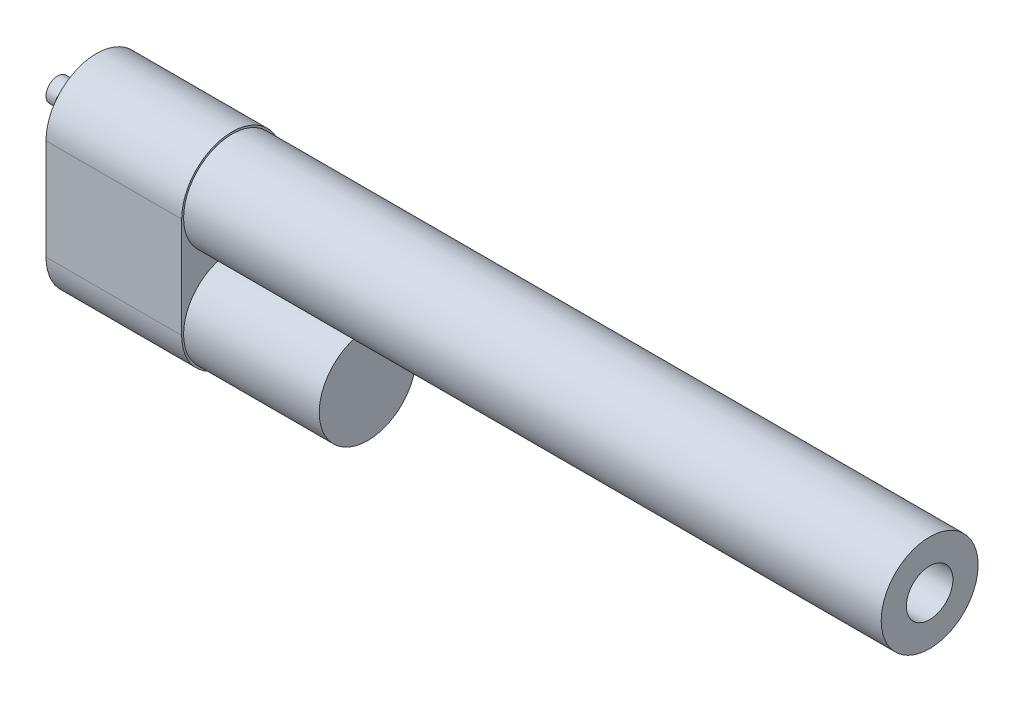
ISO-10303-21;
HEADER;
FILE_DESCRIPTION(('STEP AP214'),'2;1');
FILE_NAME('part.step','',(''),(''),'','','');
FILE_SCHEMA(('AUTOMOTIVE_DESIGN { 1 0 10303 214 1 1 1 1 }'));
ENDSEC;
DATA;
#1=APPLICATION_CONTEXT('core data for automotive mechanical design processes');
#2=APPLICATION_PROTOCOL_DEFINITION('international standard','automotive_design',2000,#1);
#3=PRODUCT_CONTEXT('',#1,'mechanical');
#4=PRODUCT('Part','Part','',(#3));
#5=PRODUCT_RELATED_PRODUCT_CATEGORY('part','',(#4));
#6=PRODUCT_DEFINITION_FORMATION('','',#4);
#7=PRODUCT_DEFINITION_CONTEXT('part definition',#1,'design');
#8=PRODUCT_DEFINITION('design','',#6,#7);
#9=PRODUCT_DEFINITION_SHAPE('','',#8);
#10=(LENGTH_UNIT() NAMED_UNIT(*) SI_UNIT(.MILLI.,.METRE.));
#11=(NAMED_UNIT(*) PLANE_ANGLE_UNIT() SI_UNIT($,.RADIAN.));
#12=(NAMED_UNIT(*) SI_UNIT($,.STERADIAN.) SOLID_ANGLE_UNIT());
#13=UNCERTAINTY_MEASURE_WITH_UNIT(LENGTH_MEASURE(1.E-05),#10,'distance_accuracy_value','');
#14=(GEOMETRIC_REPRESENTATION_CONTEXT(3) GLOBAL_UNCERTAINTY_ASSIGNED_CONTEXT((#13)) GLOBAL_UNIT_ASSIGNED_CONTEXT((#10,
#11,#12)) REPRESENTATION_CONTEXT('',''));
#15=CARTESIAN_POINT('',(0.,0.,0.));
#16=DIRECTION('',(0.,0.,1.));
#17=DIRECTION('',(1.,0.,0.));
#18=AXIS2_PLACEMENT_3D('',#15,#16,#17);
#19=CARTESIAN_POINT('',(0.,0.,0.));
#20=DIRECTION('',(-1.,0.,0.));
#21=DIRECTION('',(0.,0.,1.));
#22=AXIS2_PLACEMENT_3D('',#19,#20,#21);
#23=CYLINDRICAL_SURFACE('',#22,12.5);
#24=CARTESIAN_POINT('',(225.,0.,0.));
#25=DIRECTION('',(-1.,0.,0.));
#26=DIRECTION('',(0.,0.,1.));
#27=AXIS2_PLACEMENT_3D('',#24,#25,#26);
#28=CIRCLE('',#27,12.5);
#29=CARTESIAN_POINT('',(225.,0.,12.5));
#30=VERTEX_POINT('',#29);
#31=EDGE_CURVE('E122',#30,#30,#28,.T.);
#32=ORIENTED_EDGE('',*,*,#31,.T.);
#33=EDGE_LOOP('',(#32));
#34=FACE_BOUND('',#33,.T.);
#35=CARTESIAN_POINT('',(45.,0.,0.));
#36=DIRECTION('',(-1.,0.,0.));
#37=DIRECTION('',(0.,0.,1.));
#38=AXIS2_PLACEMENT_3D('',#35,#36,#37);
#39=CIRCLE('',#38,12.5);
#40=CARTESIAN_POINT('',(45.,0.,12.5));
#41=VERTEX_POINT('',#40);
#42=EDGE_CURVE('E43',#41,#41,#39,.T.);
#43=ORIENTED_EDGE('',*,*,#42,.F.);
#44=EDGE_LOOP('',(#43));
#45=FACE_BOUND('',#44,.T.);
#46=ADVANCED_FACE('F34',(#34,#45),#23,.T.);
#47=CARTESIAN_POINT('',(225.,12.5,0.));
#48=DIRECTION('',(-1.,0.,0.));
#49=DIRECTION('',(0.,0.,1.));
#50=AXIS2_PLACEMENT_3D('',#47,#48,#49);
#51=PLANE('',#50);
#52=CARTESIAN_POINT('',(225.,0.,0.));
#53=DIRECTION('',(1.,0.,0.));
#54=DIRECTION('',(0.,0.,-1.));
#55=AXIS2_PLACEMENT_3D('',#52,#53,#54);
#56=CIRCLE('',#55,6.);
#57=CARTESIAN_POINT('',(225.,0.,-6.));
#58=VERTEX_POINT('',#57);
#59=EDGE_CURVE('E113',#58,#58,#56,.T.);
#60=ORIENTED_EDGE('',*,*,#59,.F.);
#61=EDGE_LOOP('',(#60));
#62=FACE_BOUND('',#61,.T.);
#63=ORIENTED_EDGE('',*,*,#31,.F.);
#64=EDGE_LOOP('',(#63));
#65=FACE_BOUND('',#64,.T.);
#66=ADVANCED_FACE('F152',(#62,#65),#51,.F.);
#67=CARTESIAN_POINT('',(42.,0.,0.));
#68=DIRECTION('',(1.,0.,0.));
#69=DIRECTION('',(0.,0.,-1.));
#70=AXIS2_PLACEMENT_3D('',#67,#68,#69);
#71=CYLINDRICAL_SURFACE('',#70,6.);
#72=CARTESIAN_POINT('',(42.,0.,0.));
#73=DIRECTION('',(1.,0.,0.));
#74=DIRECTION('',(0.,0.,-1.));
#75=AXIS2_PLACEMENT_3D('',#72,#73,#74);
#76=CIRCLE('',#75,6.);
#77=CARTESIAN_POINT('',(42.,0.,-6.));
#78=VERTEX_POINT('',#77);
#79=EDGE_CURVE('E116',#78,#78,#76,.T.);
#80=ORIENTED_EDGE('',*,*,#79,.F.);
#81=EDGE_LOOP('',(#80));
#82=FACE_BOUND('',#81,.T.);
#83=ORIENTED_EDGE('',*,*,#59,.T.);
#84=EDGE_LOOP('',(#83));
#85=FACE_BOUND('',#84,.T.);
#86=ADVANCED_FACE('F150',(#82,#85),#71,.F.);
#87=CARTESIAN_POINT('',(42.,0.,0.));
#88=DIRECTION('',(1.,0.,0.));
#89=DIRECTION('',(0.,0.,-1.));
#90=AXIS2_PLACEMENT_3D('',#87,#88,#89);
#91=PLANE('',#90);
#92=ORIENTED_EDGE('',*,*,#79,.T.);
#93=EDGE_LOOP('',(#92));
#94=FACE_BOUND('',#93,.T.);
#95=ADVANCED_FACE('F182',(#94),#91,.T.);
#96=CARTESIAN_POINT('',(45.,0.,0.));
#97=DIRECTION('',(-1.,0.,0.));
#98=DIRECTION('',(0.,0.,1.));
#99=AXIS2_PLACEMENT_3D('',#96,#97,#98);
#100=CYLINDRICAL_SURFACE('',#99,13.);
#101=CARTESIAN_POINT('',(10.,0.,0.));
#102=DIRECTION('',(-1.,0.,0.));
#103=DIRECTION('',(0.,0.,1.));
#104=AXIS2_PLACEMENT_3D('',#101,#102,#103);
#105=CIRCLE('',#104,13.);
#106=CARTESIAN_POINT('',(10.,0.,13.));
#107=VERTEX_POINT('',#106);
#108=CARTESIAN_POINT('',(10.,0.,-13.));
#109=VERTEX_POINT('',#108);
#110=EDGE_CURVE('E103',#107,#109,#105,.T.);
#111=ORIENTED_EDGE('',*,*,#110,.F.);
#112=DIRECTION('',(-1.,0.,0.));
#113=VECTOR('',#112,1.);
#114=CARTESIAN_POINT('',(45.,0.,13.));
#115=LINE('',#114,#113);
#116=CARTESIAN_POINT('',(45.,0.,13.));
#117=VERTEX_POINT('',#116);
#118=EDGE_CURVE('E51',#117,#107,#115,.T.);
#119=ORIENTED_EDGE('',*,*,#118,.F.);
#120=CARTESIAN_POINT('',(45.,0.,0.));
#121=DIRECTION('',(-1.,0.,0.));
#122=DIRECTION('',(0.,0.,1.));
#123=AXIS2_PLACEMENT_3D('',#120,#121,#122);
#124=CIRCLE('',#123,13.);
#125=CARTESIAN_POINT('',(45.,0.,-13.));
#126=VERTEX_POINT('',#125);
#127=EDGE_CURVE('E96',#117,#126,#124,.T.);
#128=ORIENTED_EDGE('',*,*,#127,.T.);
#129=DIRECTION('',(-1.,0.,0.));
#130=VECTOR('',#129,1.);
#131=CARTESIAN_POINT('',(45.,0.,-13.));
#132=LINE('',#131,#130);
#133=EDGE_CURVE('E79',#126,#109,#132,.T.);
#134=ORIENTED_EDGE('',*,*,#133,.T.);
#135=EDGE_LOOP('',(#111,#119,#128,#134));
#136=FACE_BOUND('',#135,.T.);
#137=ADVANCED_FACE('F173',(#136),#100,.T.);
#138=CARTESIAN_POINT('',(45.,0.,13.));
#139=DIRECTION('',(0.,0.,1.));
#140=DIRECTION('',(1.,0.,0.));
#141=AXIS2_PLACEMENT_3D('',#138,#139,#140);
#142=PLANE('',#141);
#143=DIRECTION('',(0.,1.,0.));
#144=VECTOR('',#143,1.);
#145=CARTESIAN_POINT('',(10.,0.,13.));
#146=LINE('',#145,#144);
#147=CARTESIAN_POINT('',(10.,-26.,13.));
#148=VERTEX_POINT('',#147);
#149=EDGE_CURVE('E98',#148,#107,#146,.T.);
#150=ORIENTED_EDGE('',*,*,#149,.F.);
#151=DIRECTION('',(-1.,0.,0.));
#152=VECTOR('',#151,1.);
#153=CARTESIAN_POINT('',(45.,-26.,13.));
#154=LINE('',#153,#152);
#155=CARTESIAN_POINT('',(45.,-26.,13.));
#156=VERTEX_POINT('',#155);
#157=EDGE_CURVE('E68',#156,#148,#154,.T.);
#158=ORIENTED_EDGE('',*,*,#157,.F.);
#159=DIRECTION('',(0.,1.,0.));
#160=VECTOR('',#159,1.);
#161=CARTESIAN_POINT('',(45.,0.,13.));
#162=LINE('',#161,#160);
#163=EDGE_CURVE('E93',#156,#117,#162,.T.);
#164=ORIENTED_EDGE('',*,*,#163,.T.);
#165=ORIENTED_EDGE('',*,*,#118,.T.);
#166=EDGE_LOOP('',(#150,#158,#164,#165));
#167=FACE_BOUND('',#166,.T.);
#168=ADVANCED_FACE('F174',(#167),#142,.T.);
#169=CARTESIAN_POINT('',(45.,-26.,0.));
#170=DIRECTION('',(-1.,0.,0.));
#171=DIRECTION('',(0.,0.,1.));
#172=AXIS2_PLACEMENT_3D('',#169,#170,#171);
#173=CYLINDRICAL_SURFACE('',#172,13.);
#174=CARTESIAN_POINT('',(10.,-26.,0.));
#175=DIRECTION('',(-1.,0.,0.));
#176=DIRECTION('',(0.,0.,1.));
#177=AXIS2_PLACEMENT_3D('',#174,#175,#176);
#178=CIRCLE('',#177,13.);
#179=CARTESIAN_POINT('',(10.,-26.,-13.));
#180=VERTEX_POINT('',#179);
#181=EDGE_CURVE('E87',#180,#148,#178,.T.);
#182=ORIENTED_EDGE('',*,*,#181,.F.);
#183=DIRECTION('',(-1.,0.,0.));
#184=VECTOR('',#183,1.);
#185=CARTESIAN_POINT('',(45.,-26.,-13.));
#186=LINE('',#185,#184);
#187=CARTESIAN_POINT('',(45.,-26.,-13.));
#188=VERTEX_POINT('',#187);
#189=EDGE_CURVE('E82',#188,#180,#186,.T.);
#190=ORIENTED_EDGE('',*,*,#189,.F.);
#191=CARTESIAN_POINT('',(45.,-26.,0.));
#192=DIRECTION('',(-1.,0.,0.));
#193=DIRECTION('',(0.,0.,1.));
#194=AXIS2_PLACEMENT_3D('',#191,#192,#193);
#195=CIRCLE('',#194,13.);
#196=EDGE_CURVE('E85',#188,#156,#195,.T.);
#197=ORIENTED_EDGE('',*,*,#196,.T.);
#198=ORIENTED_EDGE('',*,*,#157,.T.);
#199=EDGE_LOOP('',(#182,#190,#197,#198));
#200=FACE_BOUND('',#199,.T.);
#201=ADVANCED_FACE('F84',(#200),#173,.T.);
#202=CARTESIAN_POINT('',(45.,0.,-13.));
#203=DIRECTION('',(0.,0.,-1.));
#204=DIRECTION('',(-1.,0.,0.));
#205=AXIS2_PLACEMENT_3D('',#202,#203,#204);
#206=PLANE('',#205);
#207=DIRECTION('',(0.,-1.,0.));
#208=VECTOR('',#207,1.);
#209=CARTESIAN_POINT('',(10.,0.,-13.));
#210=LINE('',#209,#208);
#211=EDGE_CURVE('E106',#109,#180,#210,.T.);
#212=ORIENTED_EDGE('',*,*,#211,.F.);
#213=ORIENTED_EDGE('',*,*,#133,.F.);
#214=DIRECTION('',(0.,-1.,0.));
#215=VECTOR('',#214,1.);
#216=CARTESIAN_POINT('',(45.,0.,-13.));
#217=LINE('',#216,#215);
#218=EDGE_CURVE('E92',#126,#188,#217,.T.);
#219=ORIENTED_EDGE('',*,*,#218,.T.);
#220=ORIENTED_EDGE('',*,*,#189,.T.);
#221=EDGE_LOOP('',(#212,#213,#219,#220));
#222=FACE_BOUND('',#221,.T.);
#223=ADVANCED_FACE('F95',(#222),#206,.T.);
#224=CARTESIAN_POINT('',(45.,0.,0.));
#225=DIRECTION('',(-1.,0.,0.));
#226=DIRECTION('',(0.,0.,1.));
#227=AXIS2_PLACEMENT_3D('',#224,#225,#226);
#228=PLANE('',#227);
#229=CARTESIAN_POINT('',(45.,-26.,0.));
#230=DIRECTION('',(-1.,0.,0.));
#231=DIRECTION('',(0.,0.,1.));
#232=AXIS2_PLACEMENT_3D('',#229,#230,#231);
#233=CIRCLE('',#232,12.5);
#234=CARTESIAN_POINT('',(45.,-26.,12.5));
#235=VERTEX_POINT('',#234);
#236=EDGE_CURVE('E11',#235,#235,#233,.F.);
#237=ORIENTED_EDGE('',*,*,#236,.F.);
#238=EDGE_LOOP('',(#237));
#239=FACE_BOUND('',#238,.T.);
#240=ORIENTED_EDGE('',*,*,#42,.T.);
#241=EDGE_LOOP('',(#240));
#242=FACE_BOUND('',#241,.T.);
#243=ORIENTED_EDGE('',*,*,#127,.F.);
#244=ORIENTED_EDGE('',*,*,#163,.F.);
#245=ORIENTED_EDGE('',*,*,#196,.F.);
#246=ORIENTED_EDGE('',*,*,#218,.F.);
#247=EDGE_LOOP('',(#243,#244,#245,#246));
#248=FACE_BOUND('',#247,.T.);
#249=ADVANCED_FACE('F91',(#239,#242,#248),#228,.F.);
#250=CARTESIAN_POINT('',(0.,0.,0.));
#251=DIRECTION('',(1.,0.,0.));
#252=DIRECTION('',(0.,0.,-1.));
#253=AXIS2_PLACEMENT_3D('',#250,#251,#252);
#254=PLANE('',#253);
#255=CARTESIAN_POINT('',(0.,0.,0.));
#256=DIRECTION('',(-1.,0.,0.));
#257=DIRECTION('',(0.,0.,1.));
#258=AXIS2_PLACEMENT_3D('',#255,#256,#257);
#259=CIRCLE('',#258,3.);
#260=CARTESIAN_POINT('',(0.,0.,3.));
#261=VERTEX_POINT('',#260);
#262=EDGE_CURVE('E129',#261,#261,#259,.T.);
#263=ORIENTED_EDGE('',*,*,#262,.T.);
#264=EDGE_LOOP('',(#263));
#265=FACE_BOUND('',#264,.T.);
#266=ADVANCED_FACE('F36',(#265),#254,.F.);
#267=CARTESIAN_POINT('',(5.,0.,-12.5));
#268=DIRECTION('',(0.,0.,1.));
#269=DIRECTION('',(1.,0.,0.));
#270=AXIS2_PLACEMENT_3D('',#267,#268,#269);
#271=CYLINDRICAL_SURFACE('',#270,2.5);
#272=CARTESIAN_POINT('',(7.5,0.,-3.));
#273=CARTESIAN_POINT('',(7.49999511444632,0.118757533193203,-2.99999522795205));
#274=CARTESIAN_POINT('',(7.49147749609542,0.237551281104127,-2.99288670594742));
#275=CARTESIAN_POINT('',(7.45803727664816,0.47118249249281,-2.96510762868268));
#276=CARTESIAN_POINT('',(7.43310252602469,0.586016959612417,-2.94442702942007));
#277=CARTESIAN_POINT('',(7.36868788266729,0.807829942407297,-2.89142690238865));
#278=CARTESIAN_POINT('',(7.32929492564629,0.914850920904901,-2.8591769655007));
#279=CARTESIAN_POINT('',(7.23798295205742,1.11984139043408,-2.78529176182902));
#280=CARTESIAN_POINT('',(7.18605970332675,1.21780780775233,-2.74365332434936));
#281=CARTESIAN_POINT('',(7.05054625019184,1.43789998519767,-2.63674191529867));
#282=CARTESIAN_POINT('',(6.96232979581782,1.5556821965722,-2.56840549256191));
#283=CARTESIAN_POINT('',(6.76947567424863,1.77202398328147,-2.42422624777674));
#284=CARTESIAN_POINT('',(6.66479243075689,1.87052845158605,-2.34836281453276));
#285=CARTESIAN_POINT('',(6.49591572350891,2.00437263805588,-2.23294886313738));
#286=CARTESIAN_POINT('',(6.4370444238087,2.04699726278816,-2.19383679994997));
#287=CARTESIAN_POINT('',(6.3154943970395,2.12715295529554,-2.11620611809193));
#288=CARTESIAN_POINT('',(6.25281440512926,2.16468231743739,-2.07768770195023));
#289=CARTESIAN_POINT('',(6.12373267566438,2.23441122570746,-2.00250543288661));
#290=CARTESIAN_POINT('',(6.05734021527518,2.26662332666226,-1.96583735754651));
#291=CARTESIAN_POINT('',(5.92055371607161,2.32553690612792,-1.89577686630311));
#292=CARTESIAN_POINT('',(5.85016315265821,2.3522430799868,-1.86238167220904));
#293=CARTESIAN_POINT('',(5.6983329097999,2.40193513934005,-1.79791918980412));
#294=CARTESIAN_POINT('',(5.61647590727652,2.42433807692598,-1.76736311251003));
#295=CARTESIAN_POINT('',(5.4481102311869,2.46101313675502,-1.71593180556004));
#296=CARTESIAN_POINT('',(5.36161341338533,2.47530499393792,-1.69503310194197));
#297=CARTESIAN_POINT('',(5.18423459162055,2.49481072799048,-1.66620928968844));
#298=CARTESIAN_POINT('',(5.09331204092931,2.49991205058667,-1.65844510563093));
#299=CARTESIAN_POINT('',(4.91143738699724,2.5000856937119,-1.65818308531825));
#300=CARTESIAN_POINT('',(4.82048528338467,2.49515788278404,-1.6656854491694));
#301=CARTESIAN_POINT('',(4.63447528917288,2.47505262029594,-1.69541639464497));
#302=CARTESIAN_POINT('',(4.53970625428294,2.45905577113332,-1.71881932066467));
#303=CARTESIAN_POINT('',(4.35578901879783,2.41742550503027,-1.77688235738914));
#304=CARTESIAN_POINT('',(4.26666062928518,2.39176011044289,-1.81157977103025));
#305=CARTESIAN_POINT('',(4.1121729214589,2.33816270346873,-1.88002226126137));
#306=CARTESIAN_POINT('',(4.04568775758835,2.31177513033566,-1.91250316845439));
#307=CARTESIAN_POINT('',(3.91634919322007,2.25404424958636,-1.98021996661529));
#308=CARTESIAN_POINT('',(3.85349795213416,2.22269803586306,-2.01545746697785));
#309=CARTESIAN_POINT('',(3.67003315898033,2.12149677560466,-2.12342648109724));
#310=CARTESIAN_POINT('',(3.55458585239392,2.04450664231777,-2.19837696967438));
#311=CARTESIAN_POINT('',(3.33173303754566,1.86765914501414,-2.35079897952277));
#312=CARTESIAN_POINT('',(3.22506167600812,1.76681805277628,-2.42819792618944));
#313=CARTESIAN_POINT('',(3.0288876551826,1.54484388336149,-2.57509054043285));
#314=CARTESIAN_POINT('',(2.93934796694374,1.42375565615773,-2.64460112267364));
#315=CARTESIAN_POINT('',(2.80058516090145,1.19411179169416,-2.75428914126547));
#316=CARTESIAN_POINT('',(2.74685710181235,1.08972732107277,-2.79748350073995));
#317=CARTESIAN_POINT('',(2.65365725474466,0.871071458330368,-2.87307804019801));
#318=CARTESIAN_POINT('',(2.61417656841943,0.756806292780764,-2.90548495660805));
#319=CARTESIAN_POINT('',(2.5515827500678,0.51995430121542,-2.95709834265565));
#320=CARTESIAN_POINT('',(2.52859605334244,0.39731092312531,-2.97620280955844));
#321=CARTESIAN_POINT('',(2.50129076807282,0.148559976923729,-2.99891434528972));
#322=CARTESIAN_POINT('',(2.49695968914984,0.0224547835240036,-3.00253178304177));
#323=CARTESIAN_POINT('',(2.50666243944376,-0.213310199456573,-2.99444999039147));
#324=CARTESIAN_POINT('',(2.51855863871517,-0.323130540835858,-2.98453350716313));
#325=CARTESIAN_POINT('',(2.55626695021149,-0.538644964400604,-2.95325589460135));
#326=CARTESIAN_POINT('',(2.58208073171896,-0.64433854998956,-2.93189339242796));
#327=CARTESIAN_POINT('',(2.64662339545526,-0.850565499199254,-2.87889521546186));
#328=CARTESIAN_POINT('',(2.68552078944427,-0.951010682223314,-2.84712564891974));
#329=CARTESIAN_POINT('',(2.7743956323367,-1.14365900898103,-2.77536124733889));
#330=CARTESIAN_POINT('',(2.82437717699329,-1.2358590883121,-2.73536337221808));
#331=CARTESIAN_POINT('',(2.95843179534697,-1.45067439735099,-2.62975152158594));
#332=CARTESIAN_POINT('',(3.0477325832673,-1.56834359540731,-2.56070244234714));
#333=CARTESIAN_POINT('',(3.24284038265563,-1.78428994740847,-2.41522445403191));
#334=CARTESIAN_POINT('',(3.34869845535474,-1.88250490855173,-2.33877300422835));
#335=CARTESIAN_POINT('',(3.51941196792861,-2.01573314784291,-2.22269805598601));
#336=CARTESIAN_POINT('',(3.57889827297598,-2.05811069143949,-2.1834115173603));
#337=CARTESIAN_POINT('',(3.70172081603227,-2.13771669597406,-2.10553153817181));
#338=CARTESIAN_POINT('',(3.7650584276641,-2.17494330406755,-2.06693835133607));
#339=CARTESIAN_POINT('',(3.89548840391519,-2.24398857026757,-1.9917610848264));
#340=CARTESIAN_POINT('',(3.96257022453361,-2.27582148781537,-1.95517188634212));
#341=CARTESIAN_POINT('',(4.10079010449983,-2.3338885673946,-1.88547561448179));
#342=CARTESIAN_POINT('',(4.17192437041937,-2.36012785984655,-1.8523653645079));
#343=CARTESIAN_POINT('',(4.32427036835188,-2.40837357148322,-1.78925557416047));
#344=CARTESIAN_POINT('',(4.40583445107372,-2.42988314318544,-1.75970711786654));
#345=CARTESIAN_POINT('',(4.5734519539426,-2.46482255689514,-1.71043063887427));
#346=CARTESIAN_POINT('',(4.65949357132788,-2.47827257713357,-1.69067811225259));
#347=CARTESIAN_POINT('',(4.83563760741233,-2.49617289535263,-1.6641531597946));
#348=CARTESIAN_POINT('',(4.92577532975068,-2.5005179918396,-1.65753251048391));
#349=CARTESIAN_POINT('',(5.10585321278394,-2.49938197104455,-1.65924308630667));
#350=CARTESIAN_POINT('',(5.19579331512514,-2.49389826274012,-1.66757825402155));
#351=CARTESIAN_POINT('',(5.38167257539052,-2.4726526384854,-1.69892898735519));
#352=CARTESIAN_POINT('',(5.47723027053268,-2.45585812550761,-1.72341371023858));
#353=CARTESIAN_POINT('',(5.66253129608271,-2.41250339675091,-1.78358728037387));
#354=CARTESIAN_POINT('',(5.7522542287093,-2.38591088285909,-1.81931312531326));
#355=CARTESIAN_POINT('',(5.90778904135484,-2.33050835844919,-1.88952619366194));
#356=CARTESIAN_POINT('',(5.97474375923492,-2.30325853049531,-1.92277816627791));
#357=CARTESIAN_POINT('',(6.1049463864244,-2.24370627018012,-1.9919518523057));
#358=CARTESIAN_POINT('',(6.16819211099982,-2.21140090020864,-2.0278751115052));
#359=CARTESIAN_POINT('',(6.35272956134196,-2.10716294428985,-2.13775931167912));
#360=CARTESIAN_POINT('',(6.46874692499193,-2.02793576743751,-2.2137978016432));
#361=CARTESIAN_POINT('',(6.69200726129125,-1.84629697567414,-2.36772603763546));
#362=CARTESIAN_POINT('',(6.79854179403292,-1.7429395959328,-2.44552394429512));
#363=CARTESIAN_POINT('',(6.99386379953934,-1.51553554935621,-2.59256498427754));
#364=CARTESIAN_POINT('',(7.08269056587395,-1.39153583663215,-2.66182692543068));
#365=CARTESIAN_POINT('',(7.21831419672309,-1.15855518141084,-2.76942305781508));
#366=CARTESIAN_POINT('',(7.27003851021944,-1.05399877947694,-2.81112174006882));
#367=CARTESIAN_POINT('',(7.35921867023858,-0.835439786054363,-2.88361460666452));
#368=CARTESIAN_POINT('',(7.39669352409529,-0.721450026753908,-2.9144233132377));
#369=CARTESIAN_POINT('',(7.45018845582659,-0.50662003888686,-2.9585874590469));
#370=CARTESIAN_POINT('',(7.46877512222678,-0.406845468761925,-2.97402142398111));
#371=CARTESIAN_POINT('',(7.49368236823808,-0.204722725654237,-2.99472922794408));
#372=CARTESIAN_POINT('',(7.50000421158692,-0.102374818922784,-3.00000411373941));
#373=CARTESIAN_POINT('',(7.5,0.,-3.));
#374=B_SPLINE_CURVE_WITH_KNOTS('',3,(#272,#273,#274,#275,#276,#277,#278,#279,#280,#281,#282,
#283,#284,#285,#286,#287,#288,#289,#290,#291,#292,#293,#294,#295,#296,#297,#298,#299,#300,#301,
#302,#303,#304,#305,#306,#307,#308,#309,#310,#311,#312,#313,#314,#315,#316,#317,#318,#319,#320,
#321,#322,#323,#324,#325,#326,#327,#328,#329,#330,#331,#332,#333,#334,#335,#336,#337,#338,#339,
#340,#341,#342,#343,#344,#345,#346,#347,#348,#349,#350,#351,#352,#353,#354,#355,#356,#357,#358,
#359,#360,#361,#362,#363,#364,#365,#366,#367,#368,#369,#370,#371,#372,#373),.UNSPECIFIED.,.T.,
.F.,(4,2,2,2,2,2,2,2,2,2,2,2,2,2,2,2,2,2,2,2,2,2,2,2,2,2,2,2,2,2,2,2,2,2,2,2,2,2,2,2,2,2,2,2,2,
2,2,2,2,2,4),(0.,0.355841276815113,0.711946191026961,1.06594405359551,1.42006164830116,
1.90425178760126,2.38980643116775,2.63722280423449,2.88472179650724,3.13162777943676,
3.37832232674674,3.64812890035754,3.91727616616869,4.18969776924974,4.46212294312047,
4.75723524199722,5.05333228584568,5.28870178855694,5.52420974868633,5.9954933935898,
6.49137310548271,6.98616858956867,7.36002155957575,7.73364063000475,8.11009395319721,
8.48629519274361,8.81743460677926,9.14861374669872,9.48423297747607,9.81997643164434,
10.3065635514456,10.7946819775667,11.0432812121088,11.2919696391639,11.5399899810636,
11.787781852862,12.0551105531685,12.3217671309317,12.5914881373799,12.8612802568452,
13.1598101383752,13.4593330283462,13.6977271411687,13.9362602949129,14.4135864576438,
14.914300110886,15.413889999571,15.7841228897598,16.1538601797496,16.4606444271243,
16.7673970625124),.UNSPECIFIED.);
#375=CARTESIAN_POINT('',(7.5,0.,-3.));
#376=VERTEX_POINT('',#375);
#377=EDGE_CURVE('E119',#376,#376,#374,.T.);
#378=ORIENTED_EDGE('',*,*,#377,.F.);
#379=EDGE_LOOP('',(#378));
#380=FACE_BOUND('',#379,.T.);
#381=CARTESIAN_POINT('',(7.5,0.,3.));
#382=CARTESIAN_POINT('',(7.49999511444632,-0.118757533193203,2.99999522795205));
#383=CARTESIAN_POINT('',(7.49147749609542,-0.237551281104127,2.99288670594742));
#384=CARTESIAN_POINT('',(7.45803727664816,-0.47118249249281,2.96510762868268));
#385=CARTESIAN_POINT('',(7.43310252602469,-0.586016959612417,2.94442702942007));
#386=CARTESIAN_POINT('',(7.36868788266729,-0.807829942407297,2.89142690238865));
#387=CARTESIAN_POINT('',(7.32929492564629,-0.914850920904901,2.8591769655007));
#388=CARTESIAN_POINT('',(7.23798295205742,-1.11984139043408,2.78529176182902));
#389=CARTESIAN_POINT('',(7.18605970332675,-1.21780780775233,2.74365332434936));
#390=CARTESIAN_POINT('',(7.05054625019184,-1.43789998519767,2.63674191529867));
#391=CARTESIAN_POINT('',(6.96232979581782,-1.5556821965722,2.56840549256191));
#392=CARTESIAN_POINT('',(6.76947567424863,-1.77202398328147,2.42422624777674));
#393=CARTESIAN_POINT('',(6.66479243075689,-1.87052845158605,2.34836281453276));
#394=CARTESIAN_POINT('',(6.49591572350891,-2.00437263805588,2.23294886313738));
#395=CARTESIAN_POINT('',(6.4370444238087,-2.04699726278816,2.19383679994997));
#396=CARTESIAN_POINT('',(6.3154943970395,-2.12715295529554,2.11620611809193));
#397=CARTESIAN_POINT('',(6.25281440512926,-2.16468231743739,2.07768770195023));
#398=CARTESIAN_POINT('',(6.12373267566438,-2.23441122570746,2.00250543288661));
#399=CARTESIAN_POINT('',(6.05734021527518,-2.26662332666226,1.96583735754651));
#400=CARTESIAN_POINT('',(5.92055371607161,-2.32553690612792,1.89577686630311));
#401=CARTESIAN_POINT('',(5.85016315265821,-2.3522430799868,1.86238167220904));
#402=CARTESIAN_POINT('',(5.6983329097999,-2.40193513934005,1.79791918980412));
#403=CARTESIAN_POINT('',(5.61647590727652,-2.42433807692598,1.76736311251003));
#404=CARTESIAN_POINT('',(5.4481102311869,-2.46101313675502,1.71593180556004));
#405=CARTESIAN_POINT('',(5.36161341338533,-2.47530499393792,1.69503310194197));
#406=CARTESIAN_POINT('',(5.18423459162055,-2.49481072799048,1.66620928968844));
#407=CARTESIAN_POINT('',(5.09331204092931,-2.49991205058667,1.65844510563093));
#408=CARTESIAN_POINT('',(4.91143738699724,-2.5000856937119,1.65818308531825));
#409=CARTESIAN_POINT('',(4.82048528338467,-2.49515788278404,1.6656854491694));
#410=CARTESIAN_POINT('',(4.63447528917288,-2.47505262029594,1.69541639464497));
#411=CARTESIAN_POINT('',(4.53970625428294,-2.45905577113332,1.71881932066467));
#412=CARTESIAN_POINT('',(4.35578901879783,-2.41742550503027,1.77688235738914));
#413=CARTESIAN_POINT('',(4.26666062928518,-2.39176011044289,1.81157977103025));
#414=CARTESIAN_POINT('',(4.1121729214589,-2.33816270346873,1.88002226126137));
#415=CARTESIAN_POINT('',(4.04568775758835,-2.31177513033566,1.91250316845439));
#416=CARTESIAN_POINT('',(3.91634919322007,-2.25404424958636,1.98021996661529));
#417=CARTESIAN_POINT('',(3.85349795213416,-2.22269803586306,2.01545746697785));
#418=CARTESIAN_POINT('',(3.67003315898033,-2.12149677560466,2.12342648109724));
#419=CARTESIAN_POINT('',(3.55458585239392,-2.04450664231777,2.19837696967438));
#420=CARTESIAN_POINT('',(3.33173303754566,-1.86765914501414,2.35079897952277));
#421=CARTESIAN_POINT('',(3.22506167600812,-1.76681805277628,2.42819792618944));
#422=CARTESIAN_POINT('',(3.0288876551826,-1.54484388336149,2.57509054043285));
#423=CARTESIAN_POINT('',(2.93934796694374,-1.42375565615773,2.64460112267364));
#424=CARTESIAN_POINT('',(2.80058516090145,-1.19411179169416,2.75428914126547));
#425=CARTESIAN_POINT('',(2.74685710181235,-1.08972732107277,2.79748350073995));
#426=CARTESIAN_POINT('',(2.65365725474466,-0.871071458330368,2.87307804019801));
#427=CARTESIAN_POINT('',(2.61417656841943,-0.756806292780764,2.90548495660805));
#428=CARTESIAN_POINT('',(2.5515827500678,-0.51995430121542,2.95709834265565));
#429=CARTESIAN_POINT('',(2.52859605334244,-0.39731092312531,2.97620280955844));
#430=CARTESIAN_POINT('',(2.50129076807282,-0.148559976923729,2.99891434528972));
#431=CARTESIAN_POINT('',(2.49695968914984,-0.0224547835240036,3.00253178304177));
#432=CARTESIAN_POINT('',(2.50666243944376,0.213310199456573,2.99444999039147));
#433=CARTESIAN_POINT('',(2.51855863871517,0.323130540835858,2.98453350716313));
#434=CARTESIAN_POINT('',(2.55626695021149,0.538644964400604,2.95325589460135));
#435=CARTESIAN_POINT('',(2.58208073171896,0.64433854998956,2.93189339242796));
#436=CARTESIAN_POINT('',(2.64662339545526,0.850565499199254,2.87889521546186));
#437=CARTESIAN_POINT('',(2.68552078944427,0.951010682223314,2.84712564891974));
#438=CARTESIAN_POINT('',(2.7743956323367,1.14365900898103,2.77536124733889));
#439=CARTESIAN_POINT('',(2.82437717699329,1.2358590883121,2.73536337221808));
#440=CARTESIAN_POINT('',(2.95843179534697,1.45067439735099,2.62975152158594));
#441=CARTESIAN_POINT('',(3.0477325832673,1.56834359540731,2.56070244234714));
#442=CARTESIAN_POINT('',(3.24284038265563,1.78428994740847,2.41522445403191));
#443=CARTESIAN_POINT('',(3.34869845535474,1.88250490855173,2.33877300422835));
#444=CARTESIAN_POINT('',(3.51941196792861,2.01573314784291,2.22269805598601));
#445=CARTESIAN_POINT('',(3.57889827297598,2.05811069143949,2.1834115173603));
#446=CARTESIAN_POINT('',(3.70172081603227,2.13771669597406,2.10553153817181));
#447=CARTESIAN_POINT('',(3.7650584276641,2.17494330406755,2.06693835133607));
#448=CARTESIAN_POINT('',(3.89548840391519,2.24398857026757,1.9917610848264));
#449=CARTESIAN_POINT('',(3.96257022453361,2.27582148781537,1.95517188634212));
#450=CARTESIAN_POINT('',(4.10079010449983,2.3338885673946,1.88547561448179));
#451=CARTESIAN_POINT('',(4.17192437041937,2.36012785984655,1.8523653645079));
#452=CARTESIAN_POINT('',(4.32427036835188,2.40837357148322,1.78925557416047));
#453=CARTESIAN_POINT('',(4.40583445107372,2.42988314318544,1.75970711786654));
#454=CARTESIAN_POINT('',(4.5734519539426,2.46482255689514,1.71043063887427));
#455=CARTESIAN_POINT('',(4.65949357132788,2.47827257713357,1.69067811225259));
#456=CARTESIAN_POINT('',(4.83563760741233,2.49617289535263,1.6641531597946));
#457=CARTESIAN_POINT('',(4.92577532975068,2.5005179918396,1.65753251048391));
#458=CARTESIAN_POINT('',(5.10585321278394,2.49938197104455,1.65924308630667));
#459=CARTESIAN_POINT('',(5.19579331512514,2.49389826274012,1.66757825402155));
#460=CARTESIAN_POINT('',(5.38167257539052,2.4726526384854,1.69892898735519));
#461=CARTESIAN_POINT('',(5.47723027053268,2.45585812550761,1.72341371023858));
#462=CARTESIAN_POINT('',(5.66253129608271,2.41250339675091,1.78358728037387));
#463=CARTESIAN_POINT('',(5.7522542287093,2.38591088285909,1.81931312531326));
#464=CARTESIAN_POINT('',(5.90778904135484,2.33050835844919,1.88952619366194));
#465=CARTESIAN_POINT('',(5.97474375923492,2.30325853049531,1.92277816627791));
#466=CARTESIAN_POINT('',(6.1049463864244,2.24370627018012,1.9919518523057));
#467=CARTESIAN_POINT('',(6.16819211099982,2.21140090020864,2.0278751115052));
#468=CARTESIAN_POINT('',(6.35272956134196,2.10716294428985,2.13775931167912));
#469=CARTESIAN_POINT('',(6.46874692499193,2.02793576743751,2.2137978016432));
#470=CARTESIAN_POINT('',(6.69200726129125,1.84629697567414,2.36772603763546));
#471=CARTESIAN_POINT('',(6.79854179403292,1.7429395959328,2.44552394429512));
#472=CARTESIAN_POINT('',(6.99386379953934,1.51553554935621,2.59256498427754));
#473=CARTESIAN_POINT('',(7.08269056587395,1.39153583663215,2.66182692543068));
#474=CARTESIAN_POINT('',(7.21831419672309,1.15855518141084,2.76942305781508));
#475=CARTESIAN_POINT('',(7.27003851021944,1.05399877947694,2.81112174006882));
#476=CARTESIAN_POINT('',(7.35921867023858,0.835439786054363,2.88361460666452));
#477=CARTESIAN_POINT('',(7.39669352409529,0.721450026753908,2.9144233132377));
#478=CARTESIAN_POINT('',(7.45018845582659,0.50662003888686,2.9585874590469));
#479=CARTESIAN_POINT('',(7.46877512222678,0.406845468761925,2.97402142398111));
#480=CARTESIAN_POINT('',(7.49368236823808,0.204722725654237,2.99472922794408));
#481=CARTESIAN_POINT('',(7.50000421158692,0.102374818922784,3.00000411373941));
#482=CARTESIAN_POINT('',(7.5,0.,3.));
#483=B_SPLINE_CURVE_WITH_KNOTS('',3,(#381,#382,#383,#384,#385,#386,#387,#388,#389,#390,#391,
#392,#393,#394,#395,#396,#397,#398,#399,#400,#401,#402,#403,#404,#405,#406,#407,#408,#409,#410,
#411,#412,#413,#414,#415,#416,#417,#418,#419,#420,#421,#422,#423,#424,#425,#426,#427,#428,#429,
#430,#431,#432,#433,#434,#435,#436,#437,#438,#439,#440,#441,#442,#443,#444,#445,#446,#447,#448,
#449,#450,#451,#452,#453,#454,#455,#456,#457,#458,#459,#460,#461,#462,#463,#464,#465,#466,#467,
#468,#469,#470,#471,#472,#473,#474,#475,#476,#477,#478,#479,#480,#481,#482),.UNSPECIFIED.,.T.,
.F.,(4,2,2,2,2,2,2,2,2,2,2,2,2,2,2,2,2,2,2,2,2,2,2,2,2,2,2,2,2,2,2,2,2,2,2,2,2,2,2,2,2,2,2,2,2,
2,2,2,2,2,4),(0.,0.355841276815113,0.711946191026961,1.06594405359551,1.42006164830116,
1.90425178760126,2.38980643116775,2.63722280423449,2.88472179650724,3.13162777943676,
3.37832232674674,3.64812890035754,3.91727616616869,4.18969776924974,4.46212294312047,
4.75723524199722,5.05333228584568,5.28870178855694,5.52420974868633,5.9954933935898,
6.49137310548271,6.98616858956867,7.36002155957575,7.73364063000475,8.11009395319721,
8.48629519274361,8.81743460677926,9.14861374669872,9.48423297747607,9.81997643164434,
10.3065635514456,10.7946819775667,11.0432812121088,11.2919696391639,11.5399899810636,
11.787781852862,12.0551105531685,12.3217671309317,12.5914881373799,12.8612802568452,
13.1598101383752,13.4593330283462,13.6977271411687,13.9362602949129,14.4135864576438,
14.914300110886,15.413889999571,15.7841228897598,16.1538601797496,16.4606444271243,
16.7673970625124),.UNSPECIFIED.);
#484=CARTESIAN_POINT('',(7.5,0.,3.));
#485=VERTEX_POINT('',#484);
#486=EDGE_CURVE('E126',#485,#485,#483,.T.);
#487=ORIENTED_EDGE('',*,*,#486,.F.);
#488=EDGE_LOOP('',(#487));
#489=FACE_BOUND('',#488,.T.);
#490=ADVANCED_FACE('F144',(#380,#489),#271,.F.);
#491=CARTESIAN_POINT('',(0.,0.,0.));
#492=DIRECTION('',(-1.,0.,0.));
#493=DIRECTION('',(0.,0.,1.));
#494=AXIS2_PLACEMENT_3D('',#491,#492,#493);
#495=CYLINDRICAL_SURFACE('',#494,3.);
#496=ORIENTED_EDGE('',*,*,#486,.T.);
#497=EDGE_LOOP('',(#496));
#498=FACE_BOUND('',#497,.T.);
#499=ORIENTED_EDGE('',*,*,#377,.T.);
#500=EDGE_LOOP('',(#499));
#501=FACE_BOUND('',#500,.T.);
#502=ORIENTED_EDGE('',*,*,#262,.F.);
#503=EDGE_LOOP('',(#502));
#504=FACE_BOUND('',#503,.T.);
#505=CARTESIAN_POINT('',(10.,0.,0.));
#506=DIRECTION('',(-1.,0.,0.));
#507=DIRECTION('',(0.,0.,1.));
#508=AXIS2_PLACEMENT_3D('',#505,#506,#507);
#509=CIRCLE('',#508,3.);
#510=CARTESIAN_POINT('',(10.,0.,3.));
#511=VERTEX_POINT('',#510);
#512=EDGE_CURVE('E125',#511,#511,#509,.T.);
#513=ORIENTED_EDGE('',*,*,#512,.T.);
#514=EDGE_LOOP('',(#513));
#515=FACE_BOUND('',#514,.T.);
#516=ADVANCED_FACE('F141',(#498,#501,#504,#515),#495,.T.);
#517=CARTESIAN_POINT('',(10.,3.,0.));
#518=DIRECTION('',(1.,0.,0.));
#519=DIRECTION('',(0.,0.,-1.));
#520=AXIS2_PLACEMENT_3D('',#517,#518,#519);
#521=PLANE('',#520);
#522=ORIENTED_EDGE('',*,*,#512,.F.);
#523=EDGE_LOOP('',(#522));
#524=FACE_BOUND('',#523,.T.);
#525=ORIENTED_EDGE('',*,*,#110,.T.);
#526=ORIENTED_EDGE('',*,*,#211,.T.);
#527=ORIENTED_EDGE('',*,*,#181,.T.);
#528=ORIENTED_EDGE('',*,*,#149,.T.);
#529=EDGE_LOOP('',(#525,#526,#527,#528));
#530=FACE_BOUND('',#529,.T.);
#531=ADVANCED_FACE('F159',(#524,#530),#521,.F.);
#532=CARTESIAN_POINT('',(80.,-26.,0.));
#533=DIRECTION('',(-1.,0.,0.));
#534=DIRECTION('',(0.,0.,1.));
#535=AXIS2_PLACEMENT_3D('',#532,#533,#534);
#536=CYLINDRICAL_SURFACE('',#535,12.5);
#537=CARTESIAN_POINT('',(80.,-26.,0.));
#538=DIRECTION('',(1.,0.,0.));
#539=DIRECTION('',(0.,0.,-1.));
#540=AXIS2_PLACEMENT_3D('',#537,#538,#539);
#541=CIRCLE('',#540,12.5);
#542=CARTESIAN_POINT('',(80.,-26.,-12.5));
#543=VERTEX_POINT('',#542);
#544=EDGE_CURVE('E107',#543,#543,#541,.T.);
#545=ORIENTED_EDGE('',*,*,#544,.F.);
#546=EDGE_LOOP('',(#545));
#547=FACE_BOUND('',#546,.T.);
#548=ORIENTED_EDGE('',*,*,#236,.T.);
#549=EDGE_LOOP('',(#548));
#550=FACE_BOUND('',#549,.T.);
#551=ADVANCED_FACE('F161',(#547,#550),#536,.T.);
#552=CARTESIAN_POINT('',(80.,-26.,0.));
#553=DIRECTION('',(1.,0.,0.));
#554=DIRECTION('',(0.,0.,-1.));
#555=AXIS2_PLACEMENT_3D('',#552,#553,#554);
#556=PLANE('',#555);
#557=ORIENTED_EDGE('',*,*,#544,.T.);
#558=EDGE_LOOP('',(#557));
#559=FACE_BOUND('',#558,.T.);
#560=ADVANCED_FACE('F167',(#559),#556,.T.);
#561=CLOSED_SHELL('',(#46,#66,#86,#95,#137,#168,#201,#223,#249,#266,#490,#516,#531,#551,#560));
#562=MANIFOLD_SOLID_BREP('B2',#561);
#563=ADVANCED_BREP_SHAPE_REPRESENTATION('',(#18,#562),#14);
#564=SHAPE_DEFINITION_REPRESENTATION(#9,#563);
ENDSEC;
END-ISO-10303-21;
